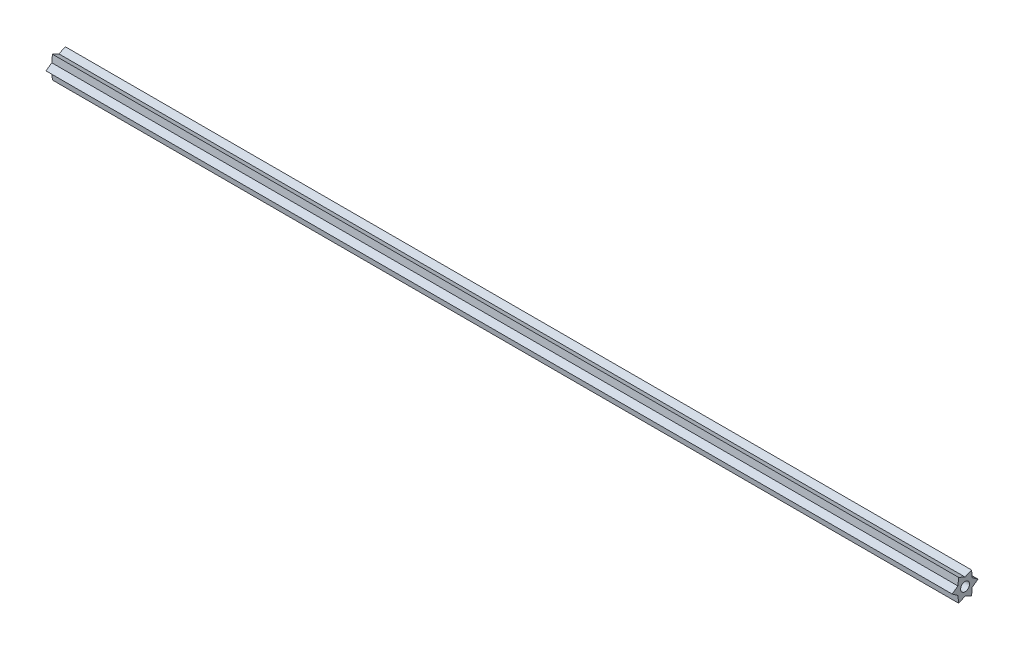
ISO-10303-21;
HEADER;
FILE_DESCRIPTION(('STEP AP214'),'2;1');
FILE_NAME('part.step','',(''),(''),'','','');
FILE_SCHEMA(('AUTOMOTIVE_DESIGN { 1 0 10303 214 1 1 1 1 }'));
ENDSEC;
DATA;
#1=APPLICATION_CONTEXT('core data for automotive mechanical design processes');
#2=APPLICATION_PROTOCOL_DEFINITION('international standard','automotive_design',2000,#1);
#3=PRODUCT_CONTEXT('',#1,'mechanical');
#4=PRODUCT('Part','Part','',(#3));
#5=PRODUCT_RELATED_PRODUCT_CATEGORY('part','',(#4));
#6=PRODUCT_DEFINITION_FORMATION('','',#4);
#7=PRODUCT_DEFINITION_CONTEXT('part definition',#1,'design');
#8=PRODUCT_DEFINITION('design','',#6,#7);
#9=PRODUCT_DEFINITION_SHAPE('','',#8);
#10=(LENGTH_UNIT() NAMED_UNIT(*) SI_UNIT(.MILLI.,.METRE.));
#11=(NAMED_UNIT(*) PLANE_ANGLE_UNIT() SI_UNIT($,.RADIAN.));
#12=(NAMED_UNIT(*) SI_UNIT($,.STERADIAN.) SOLID_ANGLE_UNIT());
#13=UNCERTAINTY_MEASURE_WITH_UNIT(LENGTH_MEASURE(1.E-05),#10,'distance_accuracy_value','');
#14=(GEOMETRIC_REPRESENTATION_CONTEXT(3) GLOBAL_UNCERTAINTY_ASSIGNED_CONTEXT((#13)) GLOBAL_UNIT_ASSIGNED_CONTEXT((#10,
#11,#12)) REPRESENTATION_CONTEXT('',''));
#15=CARTESIAN_POINT('',(0.,0.,0.));
#16=DIRECTION('',(0.,0.,1.));
#17=DIRECTION('',(1.,0.,0.));
#18=AXIS2_PLACEMENT_3D('',#15,#16,#17);
#19=CARTESIAN_POINT('',(514.35,6.35000000000001,-3.66617420935412));
#20=DIRECTION('',(0.,-0.100312494017284,0.994955980706701));
#21=DIRECTION('',(0.,-0.994955980706701,-0.100312494017284));
#22=AXIS2_PLACEMENT_3D('',#19,#20,#21);
#23=PLANE('',#22);
#24=DIRECTION('',(0.,0.994955980706701,0.100312494017284));
#25=VECTOR('',#24,1.);
#26=CARTESIAN_POINT('',(0.,6.35000000000001,-3.66617420935412));
#27=LINE('',#26,#25);
#28=CARTESIAN_POINT('',(0.,2.34953022392847,-4.06950572176281));
#29=VERTEX_POINT('',#28);
#30=CARTESIAN_POINT('',(0.,6.35000000000001,-3.66617420935412));
#31=VERTEX_POINT('',#30);
#32=EDGE_CURVE('E152',#29,#31,#27,.T.);
#33=ORIENTED_EDGE('',*,*,#32,.T.);
#34=DIRECTION('',(-1.,0.,0.));
#35=VECTOR('',#34,1.);
#36=CARTESIAN_POINT('',(514.35,6.35000000000001,-3.66617420935412));
#37=LINE('',#36,#35);
#38=CARTESIAN_POINT('',(514.35,6.35000000000001,-3.66617420935412));
#39=VERTEX_POINT('',#38);
#40=EDGE_CURVE('E11',#39,#31,#37,.T.);
#41=ORIENTED_EDGE('',*,*,#40,.F.);
#42=DIRECTION('',(0.,0.994955980706701,0.100312494017284));
#43=VECTOR('',#42,1.);
#44=CARTESIAN_POINT('',(514.35,6.35000000000001,-3.66617420935412));
#45=LINE('',#44,#43);
#46=CARTESIAN_POINT('',(514.35,2.34953022392847,-4.06950572176281));
#47=VERTEX_POINT('',#46);
#48=EDGE_CURVE('E175',#47,#39,#45,.T.);
#49=ORIENTED_EDGE('',*,*,#48,.F.);
#50=DIRECTION('',(-1.,0.,0.));
#51=VECTOR('',#50,1.);
#52=CARTESIAN_POINT('',(514.35,2.34953022392847,-4.06950572176281));
#53=LINE('',#52,#51);
#54=EDGE_CURVE('E148',#47,#29,#53,.T.);
#55=ORIENTED_EDGE('',*,*,#54,.T.);
#56=EDGE_LOOP('',(#33,#41,#49,#55));
#57=FACE_BOUND('',#56,.T.);
#58=ADVANCED_FACE('F32',(#57),#23,.F.);
#59=CARTESIAN_POINT('',(514.35,4.69906044785695,0.));
#60=DIRECTION('',(0.,-0.911813401947903,-0.410604822217413));
#61=DIRECTION('',(0.,0.410604822217413,-0.911813401947903));
#62=AXIS2_PLACEMENT_3D('',#59,#60,#61);
#63=PLANE('',#62);
#64=DIRECTION('',(0.,-0.410604822217413,0.911813401947903));
#65=VECTOR('',#64,1.);
#66=CARTESIAN_POINT('',(0.,4.69906044785695,0.));
#67=LINE('',#66,#65);
#68=CARTESIAN_POINT('',(0.,4.69906044785695,0.));
#69=VERTEX_POINT('',#68);
#70=EDGE_CURVE('E155',#31,#69,#67,.T.);
#71=ORIENTED_EDGE('',*,*,#70,.T.);
#72=DIRECTION('',(-1.,0.,0.));
#73=VECTOR('',#72,1.);
#74=CARTESIAN_POINT('',(514.35,4.69906044785695,0.));
#75=LINE('',#74,#73);
#76=CARTESIAN_POINT('',(514.35,4.69906044785695,0.));
#77=VERTEX_POINT('',#76);
#78=EDGE_CURVE('E40',#77,#69,#75,.T.);
#79=ORIENTED_EDGE('',*,*,#78,.F.);
#80=DIRECTION('',(0.,-0.410604822217413,0.911813401947903));
#81=VECTOR('',#80,1.);
#82=CARTESIAN_POINT('',(514.35,4.69906044785695,0.));
#83=LINE('',#82,#81);
#84=EDGE_CURVE('E103',#39,#77,#83,.T.);
#85=ORIENTED_EDGE('',*,*,#84,.F.);
#86=ORIENTED_EDGE('',*,*,#40,.T.);
#87=EDGE_LOOP('',(#71,#79,#85,#86));
#88=FACE_BOUND('',#87,.T.);
#89=ADVANCED_FACE('F254',(#88),#63,.F.);
#90=CARTESIAN_POINT('',(514.35,6.35000000000001,3.66617420935413));
#91=DIRECTION('',(0.,-0.911813401947903,0.410604822217412));
#92=DIRECTION('',(0.,-0.410604822217412,-0.911813401947903));
#93=AXIS2_PLACEMENT_3D('',#90,#91,#92);
#94=PLANE('',#93);
#95=DIRECTION('',(0.,0.410604822217412,0.911813401947903));
#96=VECTOR('',#95,1.);
#97=CARTESIAN_POINT('',(0.,6.35000000000001,3.66617420935413));
#98=LINE('',#97,#96);
#99=CARTESIAN_POINT('',(0.,6.35000000000001,3.66617420935413));
#100=VERTEX_POINT('',#99);
#101=EDGE_CURVE('E158',#69,#100,#98,.T.);
#102=ORIENTED_EDGE('',*,*,#101,.T.);
#103=DIRECTION('',(-1.,0.,0.));
#104=VECTOR('',#103,1.);
#105=CARTESIAN_POINT('',(514.35,6.35000000000001,3.66617420935413));
#106=LINE('',#105,#104);
#107=CARTESIAN_POINT('',(514.35,6.35000000000001,3.66617420935413));
#108=VERTEX_POINT('',#107);
#109=EDGE_CURVE('E194',#108,#100,#106,.T.);
#110=ORIENTED_EDGE('',*,*,#109,.F.);
#111=DIRECTION('',(0.,0.410604822217412,0.911813401947903));
#112=VECTOR('',#111,1.);
#113=CARTESIAN_POINT('',(514.35,6.35000000000001,3.66617420935413));
#114=LINE('',#113,#112);
#115=EDGE_CURVE('E202',#77,#108,#114,.T.);
#116=ORIENTED_EDGE('',*,*,#115,.F.);
#117=ORIENTED_EDGE('',*,*,#78,.T.);
#118=EDGE_LOOP('',(#102,#110,#116,#117));
#119=FACE_BOUND('',#118,.T.);
#120=ADVANCED_FACE('F200',(#119),#94,.F.);
#121=CARTESIAN_POINT('',(514.35,2.34953022392852,4.06950572176277));
#122=DIRECTION('',(0.,-0.100312494017276,-0.994955980706701));
#123=DIRECTION('',(0.,0.994955980706701,-0.100312494017276));
#124=AXIS2_PLACEMENT_3D('',#121,#122,#123);
#125=PLANE('',#124);
#126=DIRECTION('',(0.,-0.994955980706701,0.100312494017276));
#127=VECTOR('',#126,1.);
#128=CARTESIAN_POINT('',(0.,2.34953022392852,4.06950572176277));
#129=LINE('',#128,#127);
#130=CARTESIAN_POINT('',(0.,2.34953022392852,4.06950572176277));
#131=VERTEX_POINT('',#130);
#132=EDGE_CURVE('E160',#100,#131,#129,.T.);
#133=ORIENTED_EDGE('',*,*,#132,.T.);
#134=DIRECTION('',(-1.,0.,0.));
#135=VECTOR('',#134,1.);
#136=CARTESIAN_POINT('',(514.35,2.34953022392852,4.06950572176277));
#137=LINE('',#136,#135);
#138=CARTESIAN_POINT('',(514.35,2.34953022392852,4.06950572176277));
#139=VERTEX_POINT('',#138);
#140=EDGE_CURVE('E191',#139,#131,#137,.T.);
#141=ORIENTED_EDGE('',*,*,#140,.F.);
#142=DIRECTION('',(0.,-0.994955980706701,0.100312494017276));
#143=VECTOR('',#142,1.);
#144=CARTESIAN_POINT('',(514.35,2.34953022392852,4.06950572176277));
#145=LINE('',#144,#143);
#146=EDGE_CURVE('E220',#108,#139,#145,.T.);
#147=ORIENTED_EDGE('',*,*,#146,.F.);
#148=ORIENTED_EDGE('',*,*,#109,.T.);
#149=EDGE_LOOP('',(#133,#141,#147,#148));
#150=FACE_BOUND('',#149,.T.);
#151=ADVANCED_FACE('F211',(#150),#125,.F.);
#152=CARTESIAN_POINT('',(514.35,0.,7.33234841870826));
#153=DIRECTION('',(0.,-0.811500907930626,-0.584351158489285));
#154=DIRECTION('',(0.,0.584351158489285,-0.811500907930626));
#155=AXIS2_PLACEMENT_3D('',#152,#153,#154);
#156=PLANE('',#155);
#157=DIRECTION('',(0.,-0.584351158489285,0.811500907930626));
#158=VECTOR('',#157,1.);
#159=CARTESIAN_POINT('',(0.,0.,7.33234841870826));
#160=LINE('',#159,#158);
#161=CARTESIAN_POINT('',(0.,0.,7.33234841870826));
#162=VERTEX_POINT('',#161);
#163=EDGE_CURVE('E162',#131,#162,#160,.T.);
#164=ORIENTED_EDGE('',*,*,#163,.T.);
#165=DIRECTION('',(-1.,0.,0.));
#166=VECTOR('',#165,1.);
#167=CARTESIAN_POINT('',(514.35,0.,7.33234841870826));
#168=LINE('',#167,#166);
#169=CARTESIAN_POINT('',(514.35,0.,7.33234841870826));
#170=VERTEX_POINT('',#169);
#171=EDGE_CURVE('E188',#170,#162,#168,.T.);
#172=ORIENTED_EDGE('',*,*,#171,.F.);
#173=DIRECTION('',(0.,-0.584351158489285,0.811500907930626));
#174=VECTOR('',#173,1.);
#175=CARTESIAN_POINT('',(514.35,0.,7.33234841870826));
#176=LINE('',#175,#174);
#177=EDGE_CURVE('E217',#139,#170,#176,.T.);
#178=ORIENTED_EDGE('',*,*,#177,.F.);
#179=ORIENTED_EDGE('',*,*,#140,.T.);
#180=EDGE_LOOP('',(#164,#172,#178,#179));
#181=FACE_BOUND('',#180,.T.);
#182=ADVANCED_FACE('F215',(#181),#156,.F.);
#183=CARTESIAN_POINT('',(514.35,-2.34953022392844,4.06950572176282));
#184=DIRECTION('',(0.,0.811500907930618,-0.584351158489296));
#185=DIRECTION('',(0.,0.584351158489296,0.811500907930618));
#186=AXIS2_PLACEMENT_3D('',#183,#184,#185);
#187=PLANE('',#186);
#188=DIRECTION('',(0.,-0.584351158489296,-0.811500907930618));
#189=VECTOR('',#188,1.);
#190=CARTESIAN_POINT('',(0.,-2.34953022392844,4.06950572176282));
#191=LINE('',#190,#189);
#192=CARTESIAN_POINT('',(0.,-2.34953022392844,4.06950572176282));
#193=VERTEX_POINT('',#192);
#194=EDGE_CURVE('E164',#162,#193,#191,.T.);
#195=ORIENTED_EDGE('',*,*,#194,.T.);
#196=DIRECTION('',(-1.,0.,0.));
#197=VECTOR('',#196,1.);
#198=CARTESIAN_POINT('',(514.35,-2.34953022392844,4.06950572176282));
#199=LINE('',#198,#197);
#200=CARTESIAN_POINT('',(514.35,-2.34953022392844,4.06950572176282));
#201=VERTEX_POINT('',#200);
#202=EDGE_CURVE('E185',#201,#193,#199,.T.);
#203=ORIENTED_EDGE('',*,*,#202,.F.);
#204=DIRECTION('',(0.,-0.584351158489296,-0.811500907930618));
#205=VECTOR('',#204,1.);
#206=CARTESIAN_POINT('',(514.35,-2.34953022392844,4.06950572176282));
#207=LINE('',#206,#205);
#208=EDGE_CURVE('E219',#170,#201,#207,.T.);
#209=ORIENTED_EDGE('',*,*,#208,.F.);
#210=ORIENTED_EDGE('',*,*,#171,.T.);
#211=EDGE_LOOP('',(#195,#203,#209,#210));
#212=FACE_BOUND('',#211,.T.);
#213=ADVANCED_FACE('F267',(#212),#187,.F.);
#214=CARTESIAN_POINT('',(514.35,-6.34999999999999,3.66617420935416));
#215=DIRECTION('',(0.,0.100312494017277,-0.994955980706701));
#216=DIRECTION('',(0.,0.994955980706701,0.100312494017277));
#217=AXIS2_PLACEMENT_3D('',#214,#215,#216);
#218=PLANE('',#217);
#219=DIRECTION('',(0.,-0.994955980706701,-0.100312494017277));
#220=VECTOR('',#219,1.);
#221=CARTESIAN_POINT('',(0.,-6.34999999999999,3.66617420935416));
#222=LINE('',#221,#220);
#223=CARTESIAN_POINT('',(0.,-6.34999999999999,3.66617420935416));
#224=VERTEX_POINT('',#223);
#225=EDGE_CURVE('E166',#193,#224,#222,.T.);
#226=ORIENTED_EDGE('',*,*,#225,.T.);
#227=DIRECTION('',(-1.,0.,0.));
#228=VECTOR('',#227,1.);
#229=CARTESIAN_POINT('',(514.35,-6.34999999999999,3.66617420935416));
#230=LINE('',#229,#228);
#231=CARTESIAN_POINT('',(514.35,-6.34999999999999,3.66617420935416));
#232=VERTEX_POINT('',#231);
#233=EDGE_CURVE('E182',#232,#224,#230,.T.);
#234=ORIENTED_EDGE('',*,*,#233,.F.);
#235=DIRECTION('',(0.,-0.994955980706701,-0.100312494017277));
#236=VECTOR('',#235,1.);
#237=CARTESIAN_POINT('',(514.35,-6.34999999999999,3.66617420935416));
#238=LINE('',#237,#236);
#239=EDGE_CURVE('E222',#201,#232,#238,.T.);
#240=ORIENTED_EDGE('',*,*,#239,.F.);
#241=ORIENTED_EDGE('',*,*,#202,.T.);
#242=EDGE_LOOP('',(#226,#234,#240,#241));
#243=FACE_BOUND('',#242,.T.);
#244=ADVANCED_FACE('F270',(#243),#218,.F.);
#245=CARTESIAN_POINT('',(514.35,-4.69906044785681,1.34618993281721E-13));
#246=DIRECTION('',(0.,0.911813401947888,0.410604822217444));
#247=DIRECTION('',(0.,-0.410604822217444,0.911813401947888));
#248=AXIS2_PLACEMENT_3D('',#245,#246,#247);
#249=PLANE('',#248);
#250=DIRECTION('',(0.,0.410604822217444,-0.911813401947888));
#251=VECTOR('',#250,1.);
#252=CARTESIAN_POINT('',(0.,-4.69906044785681,1.34618993281721E-13));
#253=LINE('',#252,#251);
#254=CARTESIAN_POINT('',(0.,-4.69906044785681,1.34618993281721E-13));
#255=VERTEX_POINT('',#254);
#256=EDGE_CURVE('E168',#224,#255,#253,.T.);
#257=ORIENTED_EDGE('',*,*,#256,.T.);
#258=DIRECTION('',(-1.,0.,0.));
#259=VECTOR('',#258,1.);
#260=CARTESIAN_POINT('',(514.35,-4.69906044785681,1.34618993281721E-13));
#261=LINE('',#260,#259);
#262=CARTESIAN_POINT('',(514.35,-4.69906044785681,1.34618993281721E-13));
#263=VERTEX_POINT('',#262);
#264=EDGE_CURVE('E179',#263,#255,#261,.T.);
#265=ORIENTED_EDGE('',*,*,#264,.F.);
#266=DIRECTION('',(0.,0.410604822217444,-0.911813401947888));
#267=VECTOR('',#266,1.);
#268=CARTESIAN_POINT('',(514.35,-4.69906044785681,1.34618993281721E-13));
#269=LINE('',#268,#267);
#270=EDGE_CURVE('E228',#232,#263,#269,.T.);
#271=ORIENTED_EDGE('',*,*,#270,.F.);
#272=ORIENTED_EDGE('',*,*,#233,.T.);
#273=EDGE_LOOP('',(#257,#265,#271,#272));
#274=FACE_BOUND('',#273,.T.);
#275=ADVANCED_FACE('F234',(#274),#249,.F.);
#276=CARTESIAN_POINT('',(514.35,-6.35000000000002,-3.66617420935411));
#277=DIRECTION('',(0.,0.911813401947894,-0.410604822217432));
#278=DIRECTION('',(0.,0.410604822217432,0.911813401947894));
#279=AXIS2_PLACEMENT_3D('',#276,#277,#278);
#280=PLANE('',#279);
#281=DIRECTION('',(0.,-0.410604822217432,-0.911813401947894));
#282=VECTOR('',#281,1.);
#283=CARTESIAN_POINT('',(0.,-6.35000000000002,-3.66617420935411));
#284=LINE('',#283,#282);
#285=CARTESIAN_POINT('',(0.,-6.35000000000002,-3.66617420935411));
#286=VERTEX_POINT('',#285);
#287=EDGE_CURVE('E170',#255,#286,#284,.T.);
#288=ORIENTED_EDGE('',*,*,#287,.T.);
#289=DIRECTION('',(-1.,0.,0.));
#290=VECTOR('',#289,1.);
#291=CARTESIAN_POINT('',(514.35,-6.35000000000002,-3.66617420935411));
#292=LINE('',#291,#290);
#293=CARTESIAN_POINT('',(514.35,-6.35000000000002,-3.66617420935411));
#294=VERTEX_POINT('',#293);
#295=EDGE_CURVE('E143',#294,#286,#292,.T.);
#296=ORIENTED_EDGE('',*,*,#295,.F.);
#297=DIRECTION('',(0.,-0.410604822217432,-0.911813401947894));
#298=VECTOR('',#297,1.);
#299=CARTESIAN_POINT('',(514.35,-6.35000000000002,-3.66617420935411));
#300=LINE('',#299,#298);
#301=EDGE_CURVE('E134',#263,#294,#300,.T.);
#302=ORIENTED_EDGE('',*,*,#301,.F.);
#303=ORIENTED_EDGE('',*,*,#264,.T.);
#304=EDGE_LOOP('',(#288,#296,#302,#303));
#305=FACE_BOUND('',#304,.T.);
#306=ADVANCED_FACE('F238',(#305),#280,.F.);
#307=CARTESIAN_POINT('',(514.35,-2.34953022392843,-4.06950572176262));
#308=DIRECTION('',(0.,0.100312494017238,0.994955980706705));
#309=DIRECTION('',(0.,-0.994955980706705,0.100312494017238));
#310=AXIS2_PLACEMENT_3D('',#307,#308,#309);
#311=PLANE('',#310);
#312=DIRECTION('',(0.,0.994955980706705,-0.100312494017238));
#313=VECTOR('',#312,1.);
#314=CARTESIAN_POINT('',(0.,-2.34953022392843,-4.06950572176262));
#315=LINE('',#314,#313);
#316=CARTESIAN_POINT('',(0.,-2.34953022392843,-4.06950572176262));
#317=VERTEX_POINT('',#316);
#318=EDGE_CURVE('E142',#286,#317,#315,.T.);
#319=ORIENTED_EDGE('',*,*,#318,.T.);
#320=DIRECTION('',(-1.,0.,0.));
#321=VECTOR('',#320,1.);
#322=CARTESIAN_POINT('',(514.35,-2.34953022392843,-4.06950572176262));
#323=LINE('',#322,#321);
#324=CARTESIAN_POINT('',(514.35,-2.34953022392843,-4.06950572176262));
#325=VERTEX_POINT('',#324);
#326=EDGE_CURVE('E139',#325,#317,#323,.T.);
#327=ORIENTED_EDGE('',*,*,#326,.F.);
#328=DIRECTION('',(0.,0.994955980706705,-0.100312494017238));
#329=VECTOR('',#328,1.);
#330=CARTESIAN_POINT('',(514.35,-2.34953022392843,-4.06950572176262));
#331=LINE('',#330,#329);
#332=EDGE_CURVE('E128',#294,#325,#331,.T.);
#333=ORIENTED_EDGE('',*,*,#332,.F.);
#334=ORIENTED_EDGE('',*,*,#295,.T.);
#335=EDGE_LOOP('',(#319,#327,#333,#334));
#336=FACE_BOUND('',#335,.T.);
#337=ADVANCED_FACE('F140',(#336),#311,.F.);
#338=CARTESIAN_POINT('',(514.35,0.,-7.33234841870825));
#339=DIRECTION('',(0.,0.811500907930642,0.584351158489262));
#340=DIRECTION('',(0.,-0.584351158489262,0.811500907930642));
#341=AXIS2_PLACEMENT_3D('',#338,#339,#340);
#342=PLANE('',#341);
#343=DIRECTION('',(0.,0.584351158489262,-0.811500907930642));
#344=VECTOR('',#343,1.);
#345=CARTESIAN_POINT('',(0.,0.,-7.33234841870825));
#346=LINE('',#345,#344);
#347=CARTESIAN_POINT('',(0.,0.,-7.33234841870825));
#348=VERTEX_POINT('',#347);
#349=EDGE_CURVE('E89',#317,#348,#346,.T.);
#350=ORIENTED_EDGE('',*,*,#349,.T.);
#351=DIRECTION('',(-1.,0.,0.));
#352=VECTOR('',#351,1.);
#353=CARTESIAN_POINT('',(514.35,0.,-7.33234841870825));
#354=LINE('',#353,#352);
#355=CARTESIAN_POINT('',(514.35,0.,-7.33234841870825));
#356=VERTEX_POINT('',#355);
#357=EDGE_CURVE('E144',#356,#348,#354,.T.);
#358=ORIENTED_EDGE('',*,*,#357,.F.);
#359=DIRECTION('',(0.,0.584351158489262,-0.811500907930642));
#360=VECTOR('',#359,1.);
#361=CARTESIAN_POINT('',(514.35,0.,-7.33234841870825));
#362=LINE('',#361,#360);
#363=EDGE_CURVE('E132',#325,#356,#362,.T.);
#364=ORIENTED_EDGE('',*,*,#363,.F.);
#365=ORIENTED_EDGE('',*,*,#326,.T.);
#366=EDGE_LOOP('',(#350,#358,#364,#365));
#367=FACE_BOUND('',#366,.T.);
#368=ADVANCED_FACE('F146',(#367),#342,.F.);
#369=CARTESIAN_POINT('',(514.35,2.34953022392847,-4.06950572176281));
#370=DIRECTION('',(0.,-0.811500907930623,0.584351158489289));
#371=DIRECTION('',(0.,-0.584351158489289,-0.811500907930623));
#372=AXIS2_PLACEMENT_3D('',#369,#370,#371);
#373=PLANE('',#372);
#374=DIRECTION('',(0.,0.584351158489289,0.811500907930623));
#375=VECTOR('',#374,1.);
#376=CARTESIAN_POINT('',(0.,2.34953022392847,-4.06950572176281));
#377=LINE('',#376,#375);
#378=EDGE_CURVE('E95',#348,#29,#377,.T.);
#379=ORIENTED_EDGE('',*,*,#378,.T.);
#380=ORIENTED_EDGE('',*,*,#54,.F.);
#381=DIRECTION('',(0.,0.584351158489289,0.811500907930623));
#382=VECTOR('',#381,1.);
#383=CARTESIAN_POINT('',(514.35,2.34953022392847,-4.06950572176281));
#384=LINE('',#383,#382);
#385=EDGE_CURVE('E48',#356,#47,#384,.T.);
#386=ORIENTED_EDGE('',*,*,#385,.F.);
#387=ORIENTED_EDGE('',*,*,#357,.T.);
#388=EDGE_LOOP('',(#379,#380,#386,#387));
#389=FACE_BOUND('',#388,.T.);
#390=ADVANCED_FACE('F242',(#389),#373,.F.);
#391=CARTESIAN_POINT('',(514.35,0.,0.));
#392=DIRECTION('',(-1.,0.,0.));
#393=DIRECTION('',(0.,0.,1.));
#394=AXIS2_PLACEMENT_3D('',#391,#392,#393);
#395=PLANE('',#394);
#396=CARTESIAN_POINT('',(514.35,0.,0.));
#397=DIRECTION('',(1.,0.,0.));
#398=DIRECTION('',(0.,0.,-1.));
#399=AXIS2_PLACEMENT_3D('',#396,#397,#398);
#400=CIRCLE('',#399,2.54);
#401=CARTESIAN_POINT('',(514.35,0.,-2.54));
#402=VERTEX_POINT('',#401);
#403=EDGE_CURVE('E156',#402,#402,#400,.T.);
#404=ORIENTED_EDGE('',*,*,#403,.F.);
#405=EDGE_LOOP('',(#404));
#406=FACE_BOUND('',#405,.T.);
#407=ORIENTED_EDGE('',*,*,#48,.T.);
#408=ORIENTED_EDGE('',*,*,#84,.T.);
#409=ORIENTED_EDGE('',*,*,#115,.T.);
#410=ORIENTED_EDGE('',*,*,#146,.T.);
#411=ORIENTED_EDGE('',*,*,#177,.T.);
#412=ORIENTED_EDGE('',*,*,#208,.T.);
#413=ORIENTED_EDGE('',*,*,#239,.T.);
#414=ORIENTED_EDGE('',*,*,#270,.T.);
#415=ORIENTED_EDGE('',*,*,#301,.T.);
#416=ORIENTED_EDGE('',*,*,#332,.T.);
#417=ORIENTED_EDGE('',*,*,#363,.T.);
#418=ORIENTED_EDGE('',*,*,#385,.T.);
#419=EDGE_LOOP('',(#407,#408,#409,#410,#411,#412,#413,#414,#415,#416,#417,#418));
#420=FACE_BOUND('',#419,.T.);
#421=ADVANCED_FACE('F130',(#406,#420),#395,.F.);
#422=CARTESIAN_POINT('',(0.,0.,0.));
#423=DIRECTION('',(-1.,0.,0.));
#424=DIRECTION('',(0.,0.,1.));
#425=AXIS2_PLACEMENT_3D('',#422,#423,#424);
#426=PLANE('',#425);
#427=CARTESIAN_POINT('',(0.,0.,0.));
#428=DIRECTION('',(-1.,0.,0.));
#429=DIRECTION('',(0.,0.,1.));
#430=AXIS2_PLACEMENT_3D('',#427,#428,#429);
#431=CIRCLE('',#430,2.54);
#432=CARTESIAN_POINT('',(0.,0.,2.54));
#433=VERTEX_POINT('',#432);
#434=EDGE_CURVE('E323',#433,#433,#431,.F.);
#435=ORIENTED_EDGE('',*,*,#434,.T.);
#436=EDGE_LOOP('',(#435));
#437=FACE_BOUND('',#436,.T.);
#438=ORIENTED_EDGE('',*,*,#32,.F.);
#439=ORIENTED_EDGE('',*,*,#378,.F.);
#440=ORIENTED_EDGE('',*,*,#349,.F.);
#441=ORIENTED_EDGE('',*,*,#318,.F.);
#442=ORIENTED_EDGE('',*,*,#287,.F.);
#443=ORIENTED_EDGE('',*,*,#256,.F.);
#444=ORIENTED_EDGE('',*,*,#225,.F.);
#445=ORIENTED_EDGE('',*,*,#194,.F.);
#446=ORIENTED_EDGE('',*,*,#163,.F.);
#447=ORIENTED_EDGE('',*,*,#132,.F.);
#448=ORIENTED_EDGE('',*,*,#101,.F.);
#449=ORIENTED_EDGE('',*,*,#70,.F.);
#450=EDGE_LOOP('',(#438,#439,#440,#441,#442,#443,#444,#445,#446,#447,#448,#449));
#451=FACE_BOUND('',#450,.T.);
#452=ADVANCED_FACE('F206',(#437,#451),#426,.T.);
#453=CARTESIAN_POINT('',(-0.00100000000002876,0.,0.));
#454=DIRECTION('',(1.,0.,0.));
#455=DIRECTION('',(0.,0.,-1.));
#456=AXIS2_PLACEMENT_3D('',#453,#454,#455);
#457=CYLINDRICAL_SURFACE('',#456,2.54);
#458=ORIENTED_EDGE('',*,*,#434,.F.);
#459=EDGE_LOOP('',(#458));
#460=FACE_BOUND('',#459,.T.);
#461=ORIENTED_EDGE('',*,*,#403,.T.);
#462=EDGE_LOOP('',(#461));
#463=FACE_BOUND('',#462,.T.);
#464=ADVANCED_FACE('F307',(#460,#463),#457,.F.);
#465=CLOSED_SHELL('',(#58,#89,#120,#151,#182,#213,#244,#275,#306,#337,#368,#390,#421,#452,#464));
#466=MANIFOLD_SOLID_BREP('B2',#465);
#467=ADVANCED_BREP_SHAPE_REPRESENTATION('',(#18,#466),#14);
#468=SHAPE_DEFINITION_REPRESENTATION(#9,#467);
ENDSEC;
END-ISO-10303-21;
